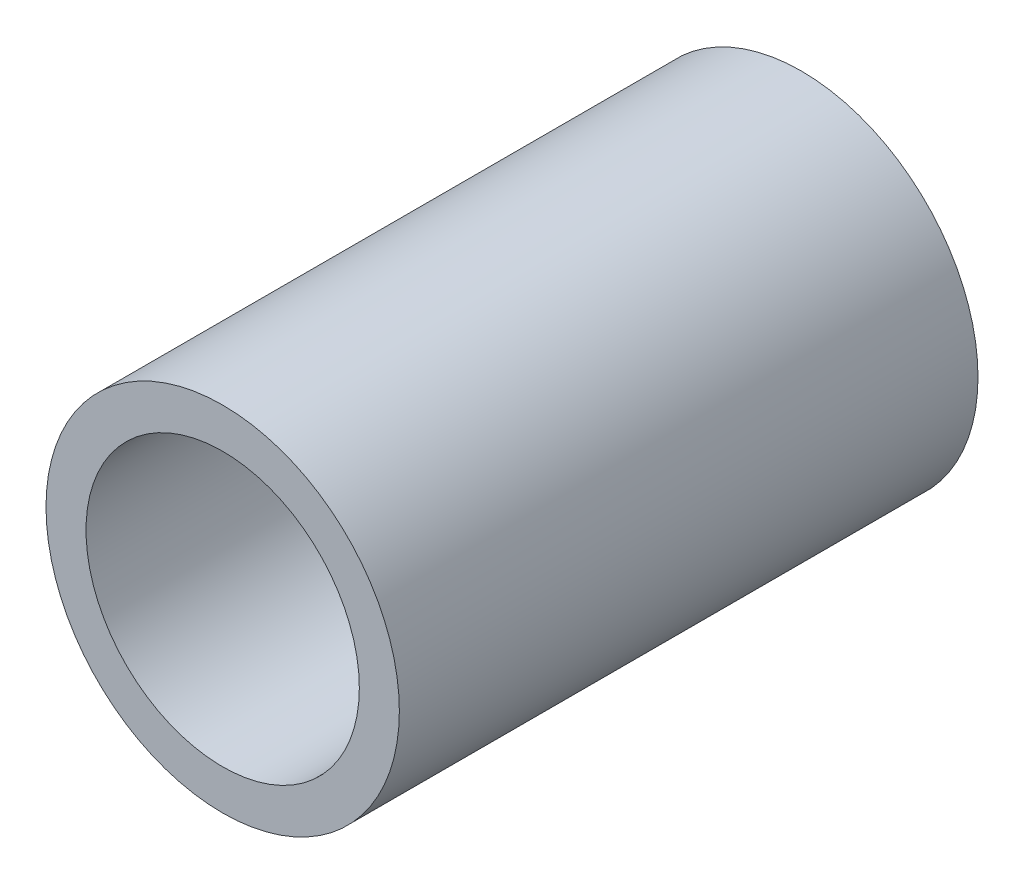
ISO-10303-21;
HEADER;
FILE_DESCRIPTION(('STEP AP214'),'2;1');
FILE_NAME('part.step','',(''),(''),'','','');
FILE_SCHEMA(('AUTOMOTIVE_DESIGN { 1 0 10303 214 1 1 1 1 }'));
ENDSEC;
DATA;
#1=APPLICATION_CONTEXT('core data for automotive mechanical design processes');
#2=APPLICATION_PROTOCOL_DEFINITION('international standard','automotive_design',2000,#1);
#3=PRODUCT_CONTEXT('',#1,'mechanical');
#4=PRODUCT('Part','Part','',(#3));
#5=PRODUCT_RELATED_PRODUCT_CATEGORY('part','',(#4));
#6=PRODUCT_DEFINITION_FORMATION('','',#4);
#7=PRODUCT_DEFINITION_CONTEXT('part definition',#1,'design');
#8=PRODUCT_DEFINITION('design','',#6,#7);
#9=PRODUCT_DEFINITION_SHAPE('','',#8);
#10=(LENGTH_UNIT() NAMED_UNIT(*) SI_UNIT(.MILLI.,.METRE.));
#11=(NAMED_UNIT(*) PLANE_ANGLE_UNIT() SI_UNIT($,.RADIAN.));
#12=(NAMED_UNIT(*) SI_UNIT($,.STERADIAN.) SOLID_ANGLE_UNIT());
#13=UNCERTAINTY_MEASURE_WITH_UNIT(LENGTH_MEASURE(1.E-05),#10,'distance_accuracy_value','');
#14=(GEOMETRIC_REPRESENTATION_CONTEXT(3) GLOBAL_UNCERTAINTY_ASSIGNED_CONTEXT((#13)) GLOBAL_UNIT_ASSIGNED_CONTEXT((#10,
#11,#12)) REPRESENTATION_CONTEXT('',''));
#15=CARTESIAN_POINT('',(0.,0.,0.));
#16=DIRECTION('',(0.,0.,1.));
#17=DIRECTION('',(1.,0.,0.));
#18=AXIS2_PLACEMENT_3D('',#15,#16,#17);
#19=CARTESIAN_POINT('',(0.,0.,0.));
#20=DIRECTION('',(0.,0.,1.));
#21=DIRECTION('',(1.,0.,0.));
#22=AXIS2_PLACEMENT_3D('',#19,#20,#21);
#23=CYLINDRICAL_SURFACE('',#22,2.9);
#24=CARTESIAN_POINT('',(0.,0.,0.));
#25=DIRECTION('',(0.,0.,1.));
#26=DIRECTION('',(1.,0.,0.));
#27=AXIS2_PLACEMENT_3D('',#24,#25,#26);
#28=CIRCLE('',#27,2.9);
#29=CARTESIAN_POINT('',(2.9,0.,0.));
#30=VERTEX_POINT('',#29);
#31=EDGE_CURVE('E44',#30,#30,#28,.T.);
#32=ORIENTED_EDGE('',*,*,#31,.F.);
#33=EDGE_LOOP('',(#32));
#34=FACE_BOUND('',#33,.T.);
#35=CARTESIAN_POINT('',(0.,0.,7.46));
#36=DIRECTION('',(0.,0.,1.));
#37=DIRECTION('',(1.,0.,0.));
#38=AXIS2_PLACEMENT_3D('',#35,#36,#37);
#39=CIRCLE('',#38,2.9);
#40=CARTESIAN_POINT('',(2.9,0.,7.46));
#41=VERTEX_POINT('',#40);
#42=EDGE_CURVE('E35',#41,#41,#39,.F.);
#43=ORIENTED_EDGE('',*,*,#42,.F.);
#44=EDGE_LOOP('',(#43));
#45=FACE_BOUND('',#44,.T.);
#46=ADVANCED_FACE('F31',(#34,#45),#23,.F.);
#47=CARTESIAN_POINT('',(0.,0.,14.46));
#48=DIRECTION('',(0.,0.,-1.));
#49=DIRECTION('',(-1.,0.,0.));
#50=AXIS2_PLACEMENT_3D('',#47,#48,#49);
#51=CYLINDRICAL_SURFACE('',#50,4.415);
#52=CARTESIAN_POINT('',(0.,0.,14.46));
#53=DIRECTION('',(0.,0.,1.));
#54=DIRECTION('',(1.,0.,0.));
#55=AXIS2_PLACEMENT_3D('',#52,#53,#54);
#56=CIRCLE('',#55,4.415);
#57=CARTESIAN_POINT('',(4.415,0.,14.46));
#58=VERTEX_POINT('',#57);
#59=EDGE_CURVE('E10',#58,#58,#56,.T.);
#60=ORIENTED_EDGE('',*,*,#59,.F.);
#61=EDGE_LOOP('',(#60));
#62=FACE_BOUND('',#61,.T.);
#63=CARTESIAN_POINT('',(0.,0.,0.));
#64=DIRECTION('',(0.,0.,1.));
#65=DIRECTION('',(1.,0.,0.));
#66=AXIS2_PLACEMENT_3D('',#63,#64,#65);
#67=CIRCLE('',#66,4.415);
#68=CARTESIAN_POINT('',(4.415,0.,0.));
#69=VERTEX_POINT('',#68);
#70=EDGE_CURVE('E39',#69,#69,#67,.T.);
#71=ORIENTED_EDGE('',*,*,#70,.T.);
#72=EDGE_LOOP('',(#71));
#73=FACE_BOUND('',#72,.T.);
#74=ADVANCED_FACE('F33',(#62,#73),#51,.T.);
#75=CARTESIAN_POINT('',(0.,0.,14.46));
#76=DIRECTION('',(0.,0.,1.));
#77=DIRECTION('',(1.,0.,0.));
#78=AXIS2_PLACEMENT_3D('',#75,#76,#77);
#79=PLANE('',#78);
#80=CARTESIAN_POINT('',(0.,0.,14.46));
#81=DIRECTION('',(0.,0.,1.));
#82=DIRECTION('',(1.,0.,0.));
#83=AXIS2_PLACEMENT_3D('',#80,#81,#82);
#84=CIRCLE('',#83,3.415);
#85=CARTESIAN_POINT('',(3.415,0.,14.46));
#86=VERTEX_POINT('',#85);
#87=EDGE_CURVE('E48',#86,#86,#84,.T.);
#88=ORIENTED_EDGE('',*,*,#87,.F.);
#89=EDGE_LOOP('',(#88));
#90=FACE_BOUND('',#89,.T.);
#91=ORIENTED_EDGE('',*,*,#59,.T.);
#92=EDGE_LOOP('',(#91));
#93=FACE_BOUND('',#92,.T.);
#94=ADVANCED_FACE('F66',(#90,#93),#79,.T.);
#95=CARTESIAN_POINT('',(0.,0.,0.));
#96=DIRECTION('',(0.,0.,1.));
#97=DIRECTION('',(1.,0.,0.));
#98=AXIS2_PLACEMENT_3D('',#95,#96,#97);
#99=PLANE('',#98);
#100=ORIENTED_EDGE('',*,*,#31,.T.);
#101=EDGE_LOOP('',(#100));
#102=FACE_BOUND('',#101,.T.);
#103=ORIENTED_EDGE('',*,*,#70,.F.);
#104=EDGE_LOOP('',(#103));
#105=FACE_BOUND('',#104,.T.);
#106=ADVANCED_FACE('F74',(#102,#105),#99,.F.);
#107=CARTESIAN_POINT('',(0.,0.,7.46));
#108=DIRECTION('',(0.,0.,1.));
#109=DIRECTION('',(1.,0.,0.));
#110=AXIS2_PLACEMENT_3D('',#107,#108,#109);
#111=PLANE('',#110);
#112=CARTESIAN_POINT('',(0.,0.,7.46));
#113=DIRECTION('',(0.,0.,1.));
#114=DIRECTION('',(1.,0.,0.));
#115=AXIS2_PLACEMENT_3D('',#112,#113,#114);
#116=CIRCLE('',#115,3.415);
#117=CARTESIAN_POINT('',(3.415,0.,7.46));
#118=VERTEX_POINT('',#117);
#119=EDGE_CURVE('E51',#118,#118,#116,.T.);
#120=ORIENTED_EDGE('',*,*,#119,.T.);
#121=EDGE_LOOP('',(#120));
#122=FACE_BOUND('',#121,.T.);
#123=ORIENTED_EDGE('',*,*,#42,.T.);
#124=EDGE_LOOP('',(#123));
#125=FACE_BOUND('',#124,.T.);
#126=ADVANCED_FACE('F58',(#122,#125),#111,.T.);
#127=CARTESIAN_POINT('',(0.,0.,7.46));
#128=DIRECTION('',(0.,0.,1.));
#129=DIRECTION('',(1.,0.,0.));
#130=AXIS2_PLACEMENT_3D('',#127,#128,#129);
#131=CYLINDRICAL_SURFACE('',#130,3.415);
#132=ORIENTED_EDGE('',*,*,#119,.F.);
#133=EDGE_LOOP('',(#132));
#134=FACE_BOUND('',#133,.T.);
#135=ORIENTED_EDGE('',*,*,#87,.T.);
#136=EDGE_LOOP('',(#135));
#137=FACE_BOUND('',#136,.T.);
#138=ADVANCED_FACE('F71',(#134,#137),#131,.F.);
#139=CLOSED_SHELL('',(#46,#74,#94,#106,#126,#138));
#140=MANIFOLD_SOLID_BREP('B2',#139);
#141=ADVANCED_BREP_SHAPE_REPRESENTATION('',(#18,#140),#14);
#142=SHAPE_DEFINITION_REPRESENTATION(#9,#141);
ENDSEC;
END-ISO-10303-21;
